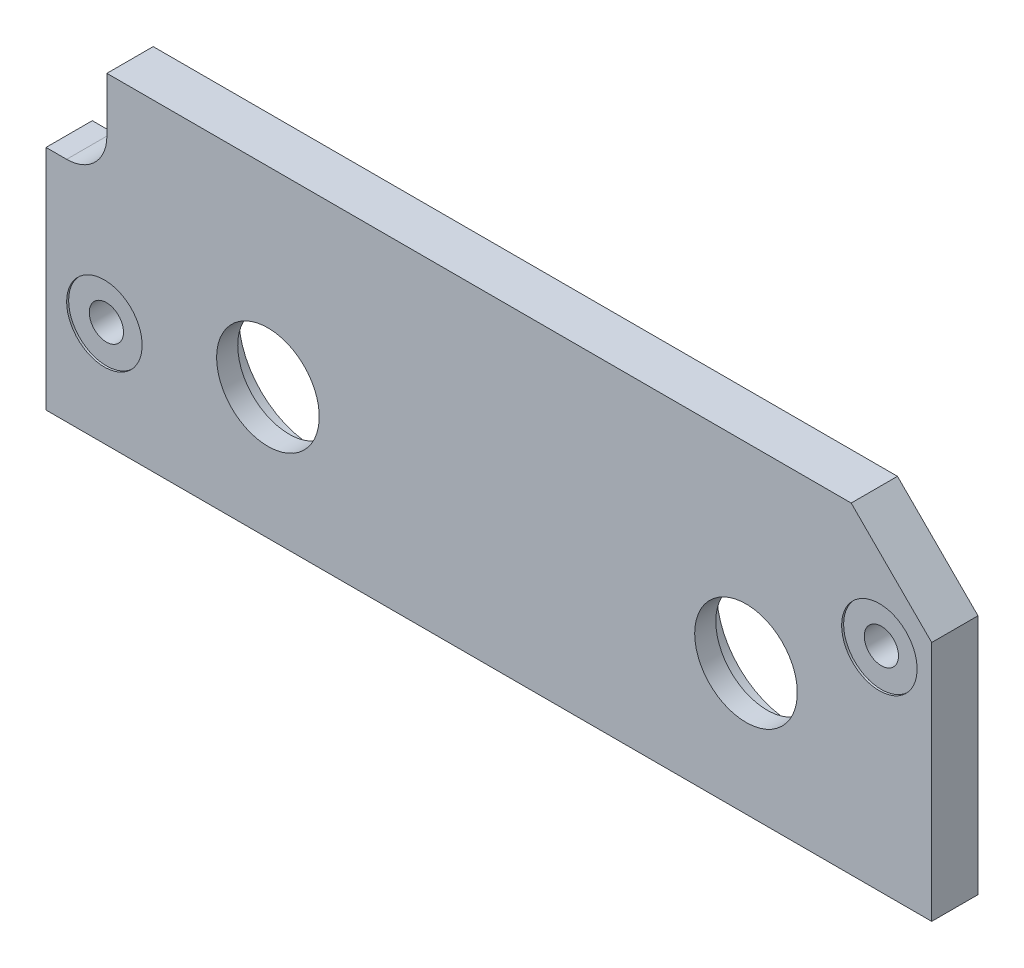
ISO-10303-21;
HEADER;
FILE_DESCRIPTION(('STEP AP214'),'2;1');
FILE_NAME('part.step','',(''),(''),'','','');
FILE_SCHEMA(('AUTOMOTIVE_DESIGN { 1 0 10303 214 1 1 1 1 }'));
ENDSEC;
DATA;
#1=APPLICATION_CONTEXT('core data for automotive mechanical design processes');
#2=APPLICATION_PROTOCOL_DEFINITION('international standard','automotive_design',2000,#1);
#3=PRODUCT_CONTEXT('',#1,'mechanical');
#4=PRODUCT('Part','Part','',(#3));
#5=PRODUCT_RELATED_PRODUCT_CATEGORY('part','',(#4));
#6=PRODUCT_DEFINITION_FORMATION('','',#4);
#7=PRODUCT_DEFINITION_CONTEXT('part definition',#1,'design');
#8=PRODUCT_DEFINITION('design','',#6,#7);
#9=PRODUCT_DEFINITION_SHAPE('','',#8);
#10=(LENGTH_UNIT() NAMED_UNIT(*) SI_UNIT(.MILLI.,.METRE.));
#11=(NAMED_UNIT(*) PLANE_ANGLE_UNIT() SI_UNIT($,.RADIAN.));
#12=(NAMED_UNIT(*) SI_UNIT($,.STERADIAN.) SOLID_ANGLE_UNIT());
#13=UNCERTAINTY_MEASURE_WITH_UNIT(LENGTH_MEASURE(1.E-05),#10,'distance_accuracy_value','');
#14=(GEOMETRIC_REPRESENTATION_CONTEXT(3) GLOBAL_UNCERTAINTY_ASSIGNED_CONTEXT((#13)) GLOBAL_UNIT_ASSIGNED_CONTEXT((#10,
#11,#12)) REPRESENTATION_CONTEXT('',''));
#15=CARTESIAN_POINT('',(0.,0.,0.));
#16=DIRECTION('',(0.,0.,1.));
#17=DIRECTION('',(1.,0.,0.));
#18=AXIS2_PLACEMENT_3D('',#15,#16,#17);
#19=CARTESIAN_POINT('',(-133.35,30.1625,7.4295));
#20=DIRECTION('',(0.,0.,-1.));
#21=DIRECTION('',(-1.,0.,0.));
#22=AXIS2_PLACEMENT_3D('',#19,#20,#21);
#23=CYLINDRICAL_SURFACE('',#22,2.15899999999999);
#24=CARTESIAN_POINT('',(-133.35,30.1625,1.5875));
#25=DIRECTION('',(0.,0.,-1.));
#26=DIRECTION('',(-1.,0.,0.));
#27=AXIS2_PLACEMENT_3D('',#24,#25,#26);
#28=CIRCLE('',#27,2.15899999999999);
#29=CARTESIAN_POINT('',(-135.509,30.1625,1.5875));
#30=VERTEX_POINT('',#29);
#31=EDGE_CURVE('E20',#30,#30,#28,.T.);
#32=ORIENTED_EDGE('',*,*,#31,.T.);
#33=EDGE_LOOP('',(#32));
#34=FACE_BOUND('',#33,.T.);
#35=CARTESIAN_POINT('',(-133.35,30.1625,7.1755));
#36=DIRECTION('',(0.,0.,-1.));
#37=DIRECTION('',(-1.,0.,0.));
#38=AXIS2_PLACEMENT_3D('',#35,#36,#37);
#39=CIRCLE('',#38,2.15899999999999);
#40=CARTESIAN_POINT('',(-135.509,30.1625,7.1755));
#41=VERTEX_POINT('',#40);
#42=EDGE_CURVE('E177',#41,#41,#39,.T.);
#43=ORIENTED_EDGE('',*,*,#42,.F.);
#44=EDGE_LOOP('',(#43));
#45=FACE_BOUND('',#44,.T.);
#46=ADVANCED_FACE('F17',(#34,#45),#23,.F.);
#47=CARTESIAN_POINT('',(-35.56,43.688,7.4295));
#48=DIRECTION('',(0.,0.,-1.));
#49=DIRECTION('',(-1.,0.,0.));
#50=AXIS2_PLACEMENT_3D('',#47,#48,#49);
#51=CYLINDRICAL_SURFACE('',#50,2.159);
#52=CARTESIAN_POINT('',(-35.56,43.688,1.5875));
#53=DIRECTION('',(0.,0.,-1.));
#54=DIRECTION('',(-1.,0.,0.));
#55=AXIS2_PLACEMENT_3D('',#52,#53,#54);
#56=CIRCLE('',#55,2.159);
#57=CARTESIAN_POINT('',(-37.719,43.688,1.5875));
#58=VERTEX_POINT('',#57);
#59=EDGE_CURVE('E185',#58,#58,#56,.T.);
#60=ORIENTED_EDGE('',*,*,#59,.T.);
#61=EDGE_LOOP('',(#60));
#62=FACE_BOUND('',#61,.T.);
#63=CARTESIAN_POINT('',(-35.56,43.688,7.1755));
#64=DIRECTION('',(0.,0.,-1.));
#65=DIRECTION('',(-1.,0.,0.));
#66=AXIS2_PLACEMENT_3D('',#63,#64,#65);
#67=CIRCLE('',#66,2.159);
#68=CARTESIAN_POINT('',(-37.719,43.688,7.1755));
#69=VERTEX_POINT('',#68);
#70=EDGE_CURVE('E174',#69,#69,#67,.T.);
#71=ORIENTED_EDGE('',*,*,#70,.F.);
#72=EDGE_LOOP('',(#71));
#73=FACE_BOUND('',#72,.T.);
#74=ADVANCED_FACE('F338',(#62,#73),#51,.F.);
#75=CARTESIAN_POINT('',(-112.7125,33.528,1.5875));
#76=DIRECTION('',(0.,0.,1.));
#77=DIRECTION('',(1.,0.,0.));
#78=AXIS2_PLACEMENT_3D('',#75,#76,#77);
#79=CYLINDRICAL_SURFACE('',#78,9.525);
#80=CARTESIAN_POINT('',(-112.7125,33.528,4.7625));
#81=DIRECTION('',(0.,0.,1.));
#82=DIRECTION('',(1.,0.,0.));
#83=AXIS2_PLACEMENT_3D('',#80,#81,#82);
#84=CIRCLE('',#83,9.525);
#85=CARTESIAN_POINT('',(-103.1875,33.528,4.7625));
#86=VERTEX_POINT('',#85);
#87=EDGE_CURVE('E171',#86,#86,#84,.F.);
#88=ORIENTED_EDGE('',*,*,#87,.F.);
#89=EDGE_LOOP('',(#88));
#90=FACE_BOUND('',#89,.T.);
#91=CARTESIAN_POINT('',(-112.7125,33.528,1.5875));
#92=DIRECTION('',(0.,0.,1.));
#93=DIRECTION('',(1.,0.,0.));
#94=AXIS2_PLACEMENT_3D('',#91,#92,#93);
#95=CIRCLE('',#94,9.525);
#96=CARTESIAN_POINT('',(-103.1875,33.528,1.5875));
#97=VERTEX_POINT('',#96);
#98=EDGE_CURVE('E183',#97,#97,#95,.F.);
#99=ORIENTED_EDGE('',*,*,#98,.T.);
#100=EDGE_LOOP('',(#99));
#101=FACE_BOUND('',#100,.T.);
#102=ADVANCED_FACE('F207',(#90,#101),#79,.F.);
#103=CARTESIAN_POINT('',(-52.3875,33.528,1.5875));
#104=DIRECTION('',(0.,0.,1.));
#105=DIRECTION('',(1.,0.,0.));
#106=AXIS2_PLACEMENT_3D('',#103,#104,#105);
#107=CYLINDRICAL_SURFACE('',#106,9.525);
#108=CARTESIAN_POINT('',(-52.3875,33.528,4.7625));
#109=DIRECTION('',(0.,0.,1.));
#110=DIRECTION('',(1.,0.,0.));
#111=AXIS2_PLACEMENT_3D('',#108,#109,#110);
#112=CIRCLE('',#111,9.525);
#113=CARTESIAN_POINT('',(-42.8625,33.528,4.7625));
#114=VERTEX_POINT('',#113);
#115=EDGE_CURVE('E100',#114,#114,#112,.F.);
#116=ORIENTED_EDGE('',*,*,#115,.F.);
#117=EDGE_LOOP('',(#116));
#118=FACE_BOUND('',#117,.T.);
#119=CARTESIAN_POINT('',(-52.3875,33.528,1.5875));
#120=DIRECTION('',(0.,0.,1.));
#121=DIRECTION('',(1.,0.,0.));
#122=AXIS2_PLACEMENT_3D('',#119,#120,#121);
#123=CIRCLE('',#122,9.525);
#124=CARTESIAN_POINT('',(-42.8625,33.528,1.5875));
#125=VERTEX_POINT('',#124);
#126=EDGE_CURVE('E180',#125,#125,#123,.F.);
#127=ORIENTED_EDGE('',*,*,#126,.T.);
#128=EDGE_LOOP('',(#127));
#129=FACE_BOUND('',#128,.T.);
#130=ADVANCED_FACE('F196',(#118,#129),#107,.F.);
#131=CARTESIAN_POINT('',(-84.836,37.338,1.5875));
#132=DIRECTION('',(0.,0.,1.));
#133=DIRECTION('',(1.,0.,0.));
#134=AXIS2_PLACEMENT_3D('',#131,#132,#133);
#135=PLANE('',#134);
#136=ORIENTED_EDGE('',*,*,#126,.F.);
#137=EDGE_LOOP('',(#136));
#138=FACE_BOUND('',#137,.T.);
#139=ORIENTED_EDGE('',*,*,#98,.F.);
#140=EDGE_LOOP('',(#139));
#141=FACE_BOUND('',#140,.T.);
#142=ORIENTED_EDGE('',*,*,#59,.F.);
#143=EDGE_LOOP('',(#142));
#144=FACE_BOUND('',#143,.T.);
#145=ORIENTED_EDGE('',*,*,#31,.F.);
#146=EDGE_LOOP('',(#145));
#147=FACE_BOUND('',#146,.T.);
#148=CARTESIAN_POINT('',(-138.1125,50.8,1.5875));
#149=DIRECTION('',(0.,0.,1.));
#150=DIRECTION('',(1.,0.,0.));
#151=AXIS2_PLACEMENT_3D('',#148,#149,#150);
#152=CIRCLE('',#151,5.08);
#153=CARTESIAN_POINT('',(-138.1125,45.72,1.5875));
#154=VERTEX_POINT('',#153);
#155=CARTESIAN_POINT('',(-133.0325,50.8,1.5875));
#156=VERTEX_POINT('',#155);
#157=EDGE_CURVE('E167',#154,#156,#152,.T.);
#158=ORIENTED_EDGE('',*,*,#157,.T.);
#159=DIRECTION('',(0.,1.,0.));
#160=VECTOR('',#159,1.);
#161=CARTESIAN_POINT('',(-133.0325,57.658,1.5875));
#162=LINE('',#161,#160);
#163=CARTESIAN_POINT('',(-133.0325,57.658,1.5875));
#164=VERTEX_POINT('',#163);
#165=EDGE_CURVE('E58',#164,#156,#162,.F.);
#166=ORIENTED_EDGE('',*,*,#165,.F.);
#167=DIRECTION('',(-1.,0.,0.));
#168=VECTOR('',#167,1.);
#169=CARTESIAN_POINT('',(-39.116,57.658,1.5875));
#170=LINE('',#169,#168);
#171=CARTESIAN_POINT('',(-39.116,57.658,1.5875));
#172=VERTEX_POINT('',#171);
#173=EDGE_CURVE('E122',#172,#164,#170,.T.);
#174=ORIENTED_EDGE('',*,*,#173,.F.);
#175=DIRECTION('',(-0.707106781186548,0.707106781186547,0.));
#176=VECTOR('',#175,1.);
#177=CARTESIAN_POINT('',(-28.956,47.498,1.5875));
#178=LINE('',#177,#176);
#179=CARTESIAN_POINT('',(-28.956,47.498,1.5875));
#180=VERTEX_POINT('',#179);
#181=EDGE_CURVE('E127',#180,#172,#178,.T.);
#182=ORIENTED_EDGE('',*,*,#181,.F.);
#183=DIRECTION('',(0.,1.,0.));
#184=VECTOR('',#183,1.);
#185=CARTESIAN_POINT('',(-28.956,17.018,1.5875));
#186=LINE('',#185,#184);
#187=CARTESIAN_POINT('',(-28.956,17.018,1.5875));
#188=VERTEX_POINT('',#187);
#189=EDGE_CURVE('E133',#188,#180,#186,.T.);
#190=ORIENTED_EDGE('',*,*,#189,.F.);
#191=DIRECTION('',(1.,0.,0.));
#192=VECTOR('',#191,1.);
#193=CARTESIAN_POINT('',(-140.716,17.0180000000001,1.5875));
#194=LINE('',#193,#192);
#195=CARTESIAN_POINT('',(-140.716,17.0180000000001,1.5875));
#196=VERTEX_POINT('',#195);
#197=EDGE_CURVE('E85',#196,#188,#194,.T.);
#198=ORIENTED_EDGE('',*,*,#197,.F.);
#199=DIRECTION('',(0.,1.,0.));
#200=VECTOR('',#199,1.);
#201=CARTESIAN_POINT('',(-140.716,45.72,1.5875));
#202=LINE('',#201,#200);
#203=CARTESIAN_POINT('',(-140.716,45.72,1.5875));
#204=VERTEX_POINT('',#203);
#205=EDGE_CURVE('E87',#204,#196,#202,.F.);
#206=ORIENTED_EDGE('',*,*,#205,.F.);
#207=DIRECTION('',(-1.,0.,0.));
#208=VECTOR('',#207,1.);
#209=CARTESIAN_POINT('',(-138.1125,45.72,1.5875));
#210=LINE('',#209,#208);
#211=EDGE_CURVE('E53',#154,#204,#210,.T.);
#212=ORIENTED_EDGE('',*,*,#211,.F.);
#213=EDGE_LOOP('',(#158,#166,#174,#182,#190,#198,#206,#212));
#214=FACE_BOUND('',#213,.T.);
#215=ADVANCED_FACE('F88',(#138,#141,#144,#147,#214),#135,.F.);
#216=CARTESIAN_POINT('',(-133.35,30.1625,7.1755));
#217=DIRECTION('',(0.,0.,1.));
#218=DIRECTION('',(1.,0.,0.));
#219=AXIS2_PLACEMENT_3D('',#216,#217,#218);
#220=PLANE('',#219);
#221=ORIENTED_EDGE('',*,*,#42,.T.);
#222=EDGE_LOOP('',(#221));
#223=FACE_BOUND('',#222,.T.);
#224=CARTESIAN_POINT('',(-133.35,30.1625,7.1755));
#225=DIRECTION('',(0.,0.,-1.));
#226=DIRECTION('',(-1.,0.,0.));
#227=AXIS2_PLACEMENT_3D('',#224,#225,#226);
#228=CIRCLE('',#227,4.7625);
#229=CARTESIAN_POINT('',(-138.1125,30.1625,7.1755));
#230=VERTEX_POINT('',#229);
#231=EDGE_CURVE('E164',#230,#230,#228,.F.);
#232=ORIENTED_EDGE('',*,*,#231,.T.);
#233=EDGE_LOOP('',(#232));
#234=FACE_BOUND('',#233,.T.);
#235=ADVANCED_FACE('F195',(#223,#234),#220,.T.);
#236=CARTESIAN_POINT('',(-35.56,43.688,7.1755));
#237=DIRECTION('',(0.,0.,1.));
#238=DIRECTION('',(1.,0.,0.));
#239=AXIS2_PLACEMENT_3D('',#236,#237,#238);
#240=PLANE('',#239);
#241=ORIENTED_EDGE('',*,*,#70,.T.);
#242=EDGE_LOOP('',(#241));
#243=FACE_BOUND('',#242,.T.);
#244=CARTESIAN_POINT('',(-35.56,43.688,7.1755));
#245=DIRECTION('',(0.,0.,-1.));
#246=DIRECTION('',(-1.,0.,0.));
#247=AXIS2_PLACEMENT_3D('',#244,#245,#246);
#248=CIRCLE('',#247,4.7625);
#249=CARTESIAN_POINT('',(-40.3225,43.688,7.1755));
#250=VERTEX_POINT('',#249);
#251=EDGE_CURVE('E161',#250,#250,#248,.F.);
#252=ORIENTED_EDGE('',*,*,#251,.T.);
#253=EDGE_LOOP('',(#252));
#254=FACE_BOUND('',#253,.T.);
#255=ADVANCED_FACE('F204',(#243,#254),#240,.T.);
#256=CARTESIAN_POINT('',(-112.7125,33.528,4.7625));
#257=DIRECTION('',(0.,0.,-1.));
#258=DIRECTION('',(-1.,0.,0.));
#259=AXIS2_PLACEMENT_3D('',#256,#257,#258);
#260=PLANE('',#259);
#261=CARTESIAN_POINT('',(-112.7125,33.528,4.7625));
#262=DIRECTION('',(0.,0.,-1.));
#263=DIRECTION('',(-1.,0.,0.));
#264=AXIS2_PLACEMENT_3D('',#261,#262,#263);
#265=CIRCLE('',#264,6.477);
#266=CARTESIAN_POINT('',(-119.1895,33.528,4.7625));
#267=VERTEX_POINT('',#266);
#268=EDGE_CURVE('E158',#267,#267,#265,.F.);
#269=ORIENTED_EDGE('',*,*,#268,.T.);
#270=EDGE_LOOP('',(#269));
#271=FACE_BOUND('',#270,.T.);
#272=ORIENTED_EDGE('',*,*,#87,.T.);
#273=EDGE_LOOP('',(#272));
#274=FACE_BOUND('',#273,.T.);
#275=ADVANCED_FACE('F266',(#271,#274),#260,.T.);
#276=CARTESIAN_POINT('',(-52.3875,33.528,4.7625));
#277=DIRECTION('',(0.,0.,-1.));
#278=DIRECTION('',(-1.,0.,0.));
#279=AXIS2_PLACEMENT_3D('',#276,#277,#278);
#280=PLANE('',#279);
#281=CARTESIAN_POINT('',(-52.3875,33.528,4.7625));
#282=DIRECTION('',(0.,0.,-1.));
#283=DIRECTION('',(-1.,0.,0.));
#284=AXIS2_PLACEMENT_3D('',#281,#282,#283);
#285=CIRCLE('',#284,6.477);
#286=CARTESIAN_POINT('',(-58.8645,33.528,4.7625));
#287=VERTEX_POINT('',#286);
#288=EDGE_CURVE('E154',#287,#287,#285,.F.);
#289=ORIENTED_EDGE('',*,*,#288,.T.);
#290=EDGE_LOOP('',(#289));
#291=FACE_BOUND('',#290,.T.);
#292=ORIENTED_EDGE('',*,*,#115,.T.);
#293=EDGE_LOOP('',(#292));
#294=FACE_BOUND('',#293,.T.);
#295=ADVANCED_FACE('F263',(#291,#294),#280,.T.);
#296=CARTESIAN_POINT('',(-138.1125,45.72,1.5875));
#297=DIRECTION('',(0.,1.,0.));
#298=DIRECTION('',(-1.,0.,0.));
#299=AXIS2_PLACEMENT_3D('',#296,#297,#298);
#300=PLANE('',#299);
#301=DIRECTION('',(1.,0.,0.));
#302=VECTOR('',#301,1.);
#303=CARTESIAN_POINT('',(-84.836,45.72,7.4295));
#304=LINE('',#303,#302);
#305=CARTESIAN_POINT('',(-138.1125,45.72,7.4295));
#306=VERTEX_POINT('',#305);
#307=CARTESIAN_POINT('',(-140.716,45.72,7.4295));
#308=VERTEX_POINT('',#307);
#309=EDGE_CURVE('E157',#306,#308,#304,.F.);
#310=ORIENTED_EDGE('',*,*,#309,.F.);
#311=DIRECTION('',(0.,0.,1.));
#312=VECTOR('',#311,1.);
#313=CARTESIAN_POINT('',(-138.1125,45.72,1.5875));
#314=LINE('',#313,#312);
#315=EDGE_CURVE('E98',#306,#154,#314,.F.);
#316=ORIENTED_EDGE('',*,*,#315,.T.);
#317=ORIENTED_EDGE('',*,*,#211,.T.);
#318=DIRECTION('',(0.,0.,1.));
#319=VECTOR('',#318,1.);
#320=CARTESIAN_POINT('',(-140.716,45.72,1.5875));
#321=LINE('',#320,#319);
#322=EDGE_CURVE('E92',#308,#204,#321,.F.);
#323=ORIENTED_EDGE('',*,*,#322,.F.);
#324=EDGE_LOOP('',(#310,#316,#317,#323));
#325=FACE_BOUND('',#324,.T.);
#326=ADVANCED_FACE('F95',(#325),#300,.T.);
#327=CARTESIAN_POINT('',(-140.716,45.72,1.5875));
#328=DIRECTION('',(-1.,0.,0.));
#329=DIRECTION('',(0.,0.,1.));
#330=AXIS2_PLACEMENT_3D('',#327,#328,#329);
#331=PLANE('',#330);
#332=DIRECTION('',(0.,1.,0.));
#333=VECTOR('',#332,1.);
#334=CARTESIAN_POINT('',(-140.716,37.338,7.4295));
#335=LINE('',#334,#333);
#336=CARTESIAN_POINT('',(-140.716,17.0180000000001,7.4295));
#337=VERTEX_POINT('',#336);
#338=EDGE_CURVE('E104',#308,#337,#335,.F.);
#339=ORIENTED_EDGE('',*,*,#338,.F.);
#340=ORIENTED_EDGE('',*,*,#322,.T.);
#341=ORIENTED_EDGE('',*,*,#205,.T.);
#342=DIRECTION('',(0.,0.,1.));
#343=VECTOR('',#342,1.);
#344=CARTESIAN_POINT('',(-140.716,17.0180000000001,1.5875));
#345=LINE('',#344,#343);
#346=EDGE_CURVE('E107',#337,#196,#345,.F.);
#347=ORIENTED_EDGE('',*,*,#346,.F.);
#348=EDGE_LOOP('',(#339,#340,#341,#347));
#349=FACE_BOUND('',#348,.T.);
#350=ADVANCED_FACE('F102',(#349),#331,.T.);
#351=CARTESIAN_POINT('',(-140.716,17.0180000000001,1.5875));
#352=DIRECTION('',(0.,-1.,0.));
#353=DIRECTION('',(1.,0.,0.));
#354=AXIS2_PLACEMENT_3D('',#351,#352,#353);
#355=PLANE('',#354);
#356=DIRECTION('',(1.,0.,0.));
#357=VECTOR('',#356,1.);
#358=CARTESIAN_POINT('',(-84.836,17.0180000000001,7.4295));
#359=LINE('',#358,#357);
#360=CARTESIAN_POINT('',(-28.956,17.018,7.4295));
#361=VERTEX_POINT('',#360);
#362=EDGE_CURVE('E319',#337,#361,#359,.T.);
#363=ORIENTED_EDGE('',*,*,#362,.F.);
#364=ORIENTED_EDGE('',*,*,#346,.T.);
#365=ORIENTED_EDGE('',*,*,#197,.T.);
#366=DIRECTION('',(0.,0.,1.));
#367=VECTOR('',#366,1.);
#368=CARTESIAN_POINT('',(-28.956,17.018,1.5875));
#369=LINE('',#368,#367);
#370=EDGE_CURVE('E130',#361,#188,#369,.F.);
#371=ORIENTED_EDGE('',*,*,#370,.F.);
#372=EDGE_LOOP('',(#363,#364,#365,#371));
#373=FACE_BOUND('',#372,.T.);
#374=ADVANCED_FACE('F254',(#373),#355,.T.);
#375=CARTESIAN_POINT('',(-28.956,17.018,1.5875));
#376=DIRECTION('',(1.,0.,0.));
#377=DIRECTION('',(0.,1.,0.));
#378=AXIS2_PLACEMENT_3D('',#375,#376,#377);
#379=PLANE('',#378);
#380=DIRECTION('',(0.,1.,0.));
#381=VECTOR('',#380,1.);
#382=CARTESIAN_POINT('',(-28.956,37.338,7.4295));
#383=LINE('',#382,#381);
#384=CARTESIAN_POINT('',(-28.956,47.498,7.4295));
#385=VERTEX_POINT('',#384);
#386=EDGE_CURVE('E310',#361,#385,#383,.T.);
#387=ORIENTED_EDGE('',*,*,#386,.F.);
#388=ORIENTED_EDGE('',*,*,#370,.T.);
#389=ORIENTED_EDGE('',*,*,#189,.T.);
#390=DIRECTION('',(0.,0.,1.));
#391=VECTOR('',#390,1.);
#392=CARTESIAN_POINT('',(-28.956,47.498,1.5875));
#393=LINE('',#392,#391);
#394=EDGE_CURVE('E124',#385,#180,#393,.F.);
#395=ORIENTED_EDGE('',*,*,#394,.F.);
#396=EDGE_LOOP('',(#387,#388,#389,#395));
#397=FACE_BOUND('',#396,.T.);
#398=ADVANCED_FACE('F250',(#397),#379,.T.);
#399=CARTESIAN_POINT('',(-28.956,47.498,1.5875));
#400=DIRECTION('',(0.707106781186547,0.707106781186548,0.));
#401=DIRECTION('',(-0.707106781186548,0.707106781186547,0.));
#402=AXIS2_PLACEMENT_3D('',#399,#400,#401);
#403=PLANE('',#402);
#404=DIRECTION('',(-0.707106781186548,0.707106781186548,0.));
#405=VECTOR('',#404,1.);
#406=CARTESIAN_POINT('',(-28.956,47.498,7.4295));
#407=LINE('',#406,#405);
#408=CARTESIAN_POINT('',(-39.116,57.658,7.4295));
#409=VERTEX_POINT('',#408);
#410=EDGE_CURVE('E290',#385,#409,#407,.T.);
#411=ORIENTED_EDGE('',*,*,#410,.F.);
#412=ORIENTED_EDGE('',*,*,#394,.T.);
#413=ORIENTED_EDGE('',*,*,#181,.T.);
#414=DIRECTION('',(0.,0.,1.));
#415=VECTOR('',#414,1.);
#416=CARTESIAN_POINT('',(-39.116,57.658,1.5875));
#417=LINE('',#416,#415);
#418=EDGE_CURVE('E119',#409,#172,#417,.F.);
#419=ORIENTED_EDGE('',*,*,#418,.F.);
#420=EDGE_LOOP('',(#411,#412,#413,#419));
#421=FACE_BOUND('',#420,.T.);
#422=ADVANCED_FACE('F246',(#421),#403,.T.);
#423=CARTESIAN_POINT('',(-39.116,57.658,1.5875));
#424=DIRECTION('',(0.,1.,0.));
#425=DIRECTION('',(-1.,0.,0.));
#426=AXIS2_PLACEMENT_3D('',#423,#424,#425);
#427=PLANE('',#426);
#428=DIRECTION('',(1.,0.,0.));
#429=VECTOR('',#428,1.);
#430=CARTESIAN_POINT('',(-84.836,57.658,7.4295));
#431=LINE('',#430,#429);
#432=CARTESIAN_POINT('',(-133.0325,57.658,7.4295));
#433=VERTEX_POINT('',#432);
#434=EDGE_CURVE('E288',#409,#433,#431,.F.);
#435=ORIENTED_EDGE('',*,*,#434,.F.);
#436=ORIENTED_EDGE('',*,*,#418,.T.);
#437=ORIENTED_EDGE('',*,*,#173,.T.);
#438=DIRECTION('',(0.,0.,1.));
#439=VECTOR('',#438,1.);
#440=CARTESIAN_POINT('',(-133.0325,57.658,1.5875));
#441=LINE('',#440,#439);
#442=EDGE_CURVE('E118',#433,#164,#441,.F.);
#443=ORIENTED_EDGE('',*,*,#442,.F.);
#444=EDGE_LOOP('',(#435,#436,#437,#443));
#445=FACE_BOUND('',#444,.T.);
#446=ADVANCED_FACE('F243',(#445),#427,.T.);
#447=CARTESIAN_POINT('',(-133.0325,57.658,1.5875));
#448=DIRECTION('',(-1.,0.,0.));
#449=DIRECTION('',(0.,0.,1.));
#450=AXIS2_PLACEMENT_3D('',#447,#448,#449);
#451=PLANE('',#450);
#452=DIRECTION('',(0.,1.,0.));
#453=VECTOR('',#452,1.);
#454=CARTESIAN_POINT('',(-133.0325,37.338,7.4295));
#455=LINE('',#454,#453);
#456=CARTESIAN_POINT('',(-133.0325,50.8,7.4295));
#457=VERTEX_POINT('',#456);
#458=EDGE_CURVE('E153',#433,#457,#455,.F.);
#459=ORIENTED_EDGE('',*,*,#458,.F.);
#460=ORIENTED_EDGE('',*,*,#442,.T.);
#461=ORIENTED_EDGE('',*,*,#165,.T.);
#462=DIRECTION('',(0.,0.,1.));
#463=VECTOR('',#462,1.);
#464=CARTESIAN_POINT('',(-133.0325,50.8,1.5875));
#465=LINE('',#464,#463);
#466=EDGE_CURVE('E35',#156,#457,#465,.T.);
#467=ORIENTED_EDGE('',*,*,#466,.T.);
#468=EDGE_LOOP('',(#459,#460,#461,#467));
#469=FACE_BOUND('',#468,.T.);
#470=ADVANCED_FACE('F239',(#469),#451,.T.);
#471=CARTESIAN_POINT('',(-138.1125,50.8,1.5875));
#472=DIRECTION('',(0.,0.,1.));
#473=DIRECTION('',(1.,0.,0.));
#474=AXIS2_PLACEMENT_3D('',#471,#472,#473);
#475=CYLINDRICAL_SURFACE('',#474,5.08);
#476=ORIENTED_EDGE('',*,*,#315,.F.);
#477=CARTESIAN_POINT('',(-138.1125,50.8,7.4295));
#478=DIRECTION('',(0.,0.,1.));
#479=DIRECTION('',(1.,0.,0.));
#480=AXIS2_PLACEMENT_3D('',#477,#478,#479);
#481=CIRCLE('',#480,5.08);
#482=EDGE_CURVE('E150',#457,#306,#481,.F.);
#483=ORIENTED_EDGE('',*,*,#482,.F.);
#484=ORIENTED_EDGE('',*,*,#466,.F.);
#485=ORIENTED_EDGE('',*,*,#157,.F.);
#486=EDGE_LOOP('',(#476,#483,#484,#485));
#487=FACE_BOUND('',#486,.T.);
#488=ADVANCED_FACE('F235',(#487),#475,.F.);
#489=CARTESIAN_POINT('',(-133.35,30.1625,7.4295));
#490=DIRECTION('',(0.,0.,-1.));
#491=DIRECTION('',(-1.,0.,0.));
#492=AXIS2_PLACEMENT_3D('',#489,#490,#491);
#493=CYLINDRICAL_SURFACE('',#492,4.7625);
#494=ORIENTED_EDGE('',*,*,#231,.F.);
#495=EDGE_LOOP('',(#494));
#496=FACE_BOUND('',#495,.T.);
#497=CARTESIAN_POINT('',(-133.35,30.1625,7.4295));
#498=DIRECTION('',(0.,0.,-1.));
#499=DIRECTION('',(-1.,0.,0.));
#500=AXIS2_PLACEMENT_3D('',#497,#498,#499);
#501=CIRCLE('',#500,4.7625);
#502=CARTESIAN_POINT('',(-138.1125,30.1625,7.4295));
#503=VERTEX_POINT('',#502);
#504=EDGE_CURVE('E147',#503,#503,#501,.T.);
#505=ORIENTED_EDGE('',*,*,#504,.F.);
#506=EDGE_LOOP('',(#505));
#507=FACE_BOUND('',#506,.T.);
#508=ADVANCED_FACE('F231',(#496,#507),#493,.F.);
#509=CARTESIAN_POINT('',(-35.56,43.688,7.4295));
#510=DIRECTION('',(0.,0.,-1.));
#511=DIRECTION('',(-1.,0.,0.));
#512=AXIS2_PLACEMENT_3D('',#509,#510,#511);
#513=CYLINDRICAL_SURFACE('',#512,4.7625);
#514=ORIENTED_EDGE('',*,*,#251,.F.);
#515=EDGE_LOOP('',(#514));
#516=FACE_BOUND('',#515,.T.);
#517=CARTESIAN_POINT('',(-35.56,43.688,7.4295));
#518=DIRECTION('',(0.,0.,-1.));
#519=DIRECTION('',(-1.,0.,0.));
#520=AXIS2_PLACEMENT_3D('',#517,#518,#519);
#521=CIRCLE('',#520,4.7625);
#522=CARTESIAN_POINT('',(-40.3225,43.688,7.4295));
#523=VERTEX_POINT('',#522);
#524=EDGE_CURVE('E144',#523,#523,#521,.T.);
#525=ORIENTED_EDGE('',*,*,#524,.F.);
#526=EDGE_LOOP('',(#525));
#527=FACE_BOUND('',#526,.T.);
#528=ADVANCED_FACE('F227',(#516,#527),#513,.F.);
#529=CARTESIAN_POINT('',(-112.7125,33.528,7.4295));
#530=DIRECTION('',(0.,0.,-1.));
#531=DIRECTION('',(-1.,0.,0.));
#532=AXIS2_PLACEMENT_3D('',#529,#530,#531);
#533=CYLINDRICAL_SURFACE('',#532,6.477);
#534=ORIENTED_EDGE('',*,*,#268,.F.);
#535=EDGE_LOOP('',(#534));
#536=FACE_BOUND('',#535,.T.);
#537=CARTESIAN_POINT('',(-112.7125,33.528,7.4295));
#538=DIRECTION('',(0.,0.,-1.));
#539=DIRECTION('',(-1.,0.,0.));
#540=AXIS2_PLACEMENT_3D('',#537,#538,#539);
#541=CIRCLE('',#540,6.477);
#542=CARTESIAN_POINT('',(-119.1895,33.528,7.4295));
#543=VERTEX_POINT('',#542);
#544=EDGE_CURVE('E26',#543,#543,#541,.T.);
#545=ORIENTED_EDGE('',*,*,#544,.F.);
#546=EDGE_LOOP('',(#545));
#547=FACE_BOUND('',#546,.T.);
#548=ADVANCED_FACE('F220',(#536,#547),#533,.F.);
#549=CARTESIAN_POINT('',(-52.3875,33.528,7.4295));
#550=DIRECTION('',(0.,0.,-1.));
#551=DIRECTION('',(-1.,0.,0.));
#552=AXIS2_PLACEMENT_3D('',#549,#550,#551);
#553=CYLINDRICAL_SURFACE('',#552,6.477);
#554=ORIENTED_EDGE('',*,*,#288,.F.);
#555=EDGE_LOOP('',(#554));
#556=FACE_BOUND('',#555,.T.);
#557=CARTESIAN_POINT('',(-52.3875,33.528,7.4295));
#558=DIRECTION('',(0.,0.,-1.));
#559=DIRECTION('',(-1.,0.,0.));
#560=AXIS2_PLACEMENT_3D('',#557,#558,#559);
#561=CIRCLE('',#560,6.477);
#562=CARTESIAN_POINT('',(-58.8645,33.528,7.4295));
#563=VERTEX_POINT('',#562);
#564=EDGE_CURVE('E11',#563,#563,#561,.T.);
#565=ORIENTED_EDGE('',*,*,#564,.F.);
#566=EDGE_LOOP('',(#565));
#567=FACE_BOUND('',#566,.T.);
#568=ADVANCED_FACE('F214',(#556,#567),#553,.F.);
#569=CARTESIAN_POINT('',(-84.836,37.338,7.4295));
#570=DIRECTION('',(0.,0.,1.));
#571=DIRECTION('',(1.,0.,0.));
#572=AXIS2_PLACEMENT_3D('',#569,#570,#571);
#573=PLANE('',#572);
#574=ORIENTED_EDGE('',*,*,#564,.T.);
#575=EDGE_LOOP('',(#574));
#576=FACE_BOUND('',#575,.T.);
#577=ORIENTED_EDGE('',*,*,#544,.T.);
#578=EDGE_LOOP('',(#577));
#579=FACE_BOUND('',#578,.T.);
#580=ORIENTED_EDGE('',*,*,#524,.T.);
#581=EDGE_LOOP('',(#580));
#582=FACE_BOUND('',#581,.T.);
#583=ORIENTED_EDGE('',*,*,#504,.T.);
#584=EDGE_LOOP('',(#583));
#585=FACE_BOUND('',#584,.T.);
#586=ORIENTED_EDGE('',*,*,#458,.T.);
#587=ORIENTED_EDGE('',*,*,#482,.T.);
#588=ORIENTED_EDGE('',*,*,#309,.T.);
#589=ORIENTED_EDGE('',*,*,#338,.T.);
#590=ORIENTED_EDGE('',*,*,#362,.T.);
#591=ORIENTED_EDGE('',*,*,#386,.T.);
#592=ORIENTED_EDGE('',*,*,#410,.T.);
#593=ORIENTED_EDGE('',*,*,#434,.T.);
#594=EDGE_LOOP('',(#586,#587,#588,#589,#590,#591,#592,#593));
#595=FACE_BOUND('',#594,.T.);
#596=ADVANCED_FACE('F212',(#576,#579,#582,#585,#595),#573,.T.);
#597=CLOSED_SHELL('',(#46,#74,#102,#130,#215,#235,#255,#275,#295,#326,#350,#374,#398,#422,#446,
#470,#488,#508,#528,#548,#568,#596));
#598=MANIFOLD_SOLID_BREP('B1',#597);
#599=ADVANCED_BREP_SHAPE_REPRESENTATION('',(#18,#598),#14);
#600=SHAPE_DEFINITION_REPRESENTATION(#9,#599);
ENDSEC;
END-ISO-10303-21;
